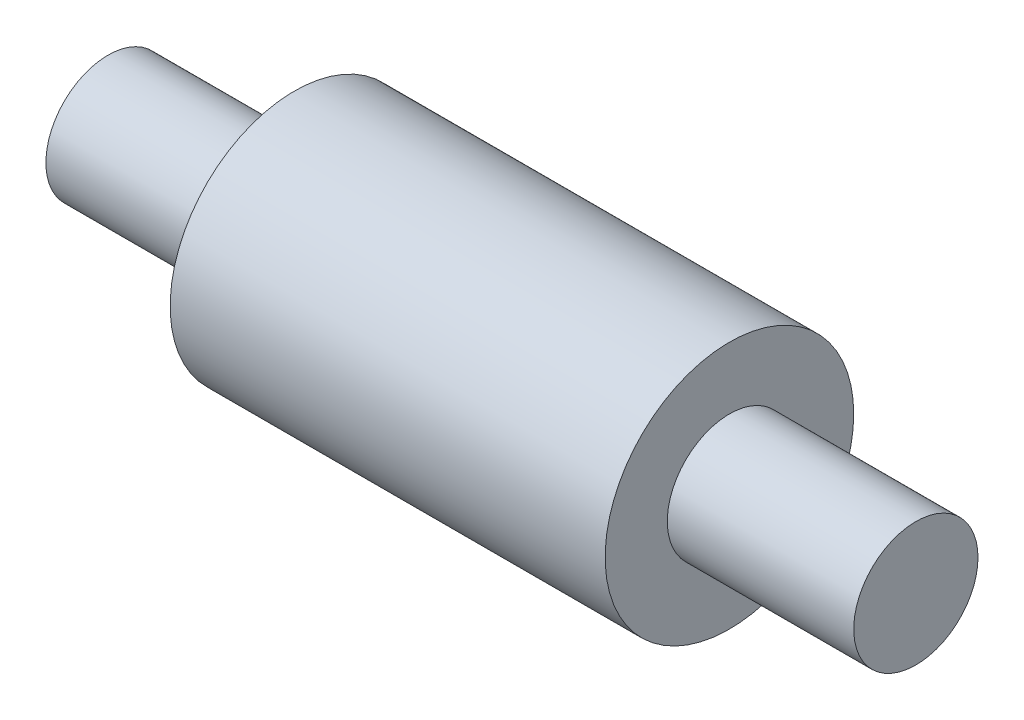
ISO-10303-21;
HEADER;
FILE_DESCRIPTION(('STEP AP214'),'2;1');
FILE_NAME('part.step','',(''),(''),'','','');
FILE_SCHEMA(('AUTOMOTIVE_DESIGN { 1 0 10303 214 1 1 1 1 }'));
ENDSEC;
DATA;
#1=APPLICATION_CONTEXT('core data for automotive mechanical design processes');
#2=APPLICATION_PROTOCOL_DEFINITION('international standard','automotive_design',2000,#1);
#3=PRODUCT_CONTEXT('',#1,'mechanical');
#4=PRODUCT('Part','Part','',(#3));
#5=PRODUCT_RELATED_PRODUCT_CATEGORY('part','',(#4));
#6=PRODUCT_DEFINITION_FORMATION('','',#4);
#7=PRODUCT_DEFINITION_CONTEXT('part definition',#1,'design');
#8=PRODUCT_DEFINITION('design','',#6,#7);
#9=PRODUCT_DEFINITION_SHAPE('','',#8);
#10=(LENGTH_UNIT() NAMED_UNIT(*) SI_UNIT(.MILLI.,.METRE.));
#11=(NAMED_UNIT(*) PLANE_ANGLE_UNIT() SI_UNIT($,.RADIAN.));
#12=(NAMED_UNIT(*) SI_UNIT($,.STERADIAN.) SOLID_ANGLE_UNIT());
#13=UNCERTAINTY_MEASURE_WITH_UNIT(LENGTH_MEASURE(1.E-05),#10,'distance_accuracy_value','');
#14=(GEOMETRIC_REPRESENTATION_CONTEXT(3) GLOBAL_UNCERTAINTY_ASSIGNED_CONTEXT((#13)) GLOBAL_UNIT_ASSIGNED_CONTEXT((#10,
#11,#12)) REPRESENTATION_CONTEXT('',''));
#15=CARTESIAN_POINT('',(0.,0.,0.));
#16=DIRECTION('',(0.,0.,1.));
#17=DIRECTION('',(1.,0.,0.));
#18=AXIS2_PLACEMENT_3D('',#15,#16,#17);
#19=CARTESIAN_POINT('',(-56.0165730239612,0.,0.));
#20=DIRECTION('',(-1.,0.,0.));
#21=DIRECTION('',(0.,0.,1.));
#22=AXIS2_PLACEMENT_3D('',#19,#20,#21);
#23=PLANE('',#22);
#24=CARTESIAN_POINT('',(-56.0165730239612,0.,4.07350323813278E-13));
#25=DIRECTION('',(1.,0.,0.));
#26=DIRECTION('',(0.,0.,-1.));
#27=AXIS2_PLACEMENT_3D('',#24,#25,#26);
#28=CIRCLE('',#27,10.0000000000004);
#29=CARTESIAN_POINT('',(-56.0165730239613,0.,-9.99999999999999));
#30=VERTEX_POINT('',#29);
#31=EDGE_CURVE('E10',#30,#30,#28,.T.);
#32=ORIENTED_EDGE('',*,*,#31,.F.);
#33=EDGE_LOOP('',(#32));
#34=FACE_BOUND('',#33,.T.);
#35=ADVANCED_FACE('F31',(#34),#23,.T.);
#36=CARTESIAN_POINT('',(0.,0.,0.));
#37=DIRECTION('',(1.,0.,0.));
#38=DIRECTION('',(0.,0.,-1.));
#39=AXIS2_PLACEMENT_3D('',#36,#37,#38);
#40=CYLINDRICAL_SURFACE('',#39,10.0000000000003);
#41=ORIENTED_EDGE('',*,*,#31,.T.);
#42=EDGE_LOOP('',(#41));
#43=FACE_BOUND('',#42,.T.);
#44=CARTESIAN_POINT('',(-26.0165730239612,0.,1.89191499474435E-13));
#45=DIRECTION('',(1.,0.,0.));
#46=DIRECTION('',(0.,0.,-1.));
#47=AXIS2_PLACEMENT_3D('',#44,#45,#46);
#48=CIRCLE('',#47,10.0000000000002);
#49=CARTESIAN_POINT('',(-26.0165730239613,0.,-9.99999999999999));
#50=VERTEX_POINT('',#49);
#51=EDGE_CURVE('E37',#50,#50,#48,.T.);
#52=ORIENTED_EDGE('',*,*,#51,.F.);
#53=EDGE_LOOP('',(#52));
#54=FACE_BOUND('',#53,.T.);
#55=ADVANCED_FACE('F73',(#43,#54),#40,.T.);
#56=CARTESIAN_POINT('',(-26.0165730239613,0.,-20.));
#57=DIRECTION('',(-1.,0.,0.));
#58=DIRECTION('',(0.,0.,1.));
#59=AXIS2_PLACEMENT_3D('',#56,#57,#58);
#60=PLANE('',#59);
#61=ORIENTED_EDGE('',*,*,#51,.T.);
#62=EDGE_LOOP('',(#61));
#63=FACE_BOUND('',#62,.T.);
#64=CARTESIAN_POINT('',(-26.0165730239611,0.,1.89191499474434E-13));
#65=DIRECTION('',(1.,0.,0.));
#66=DIRECTION('',(0.,0.,-1.));
#67=AXIS2_PLACEMENT_3D('',#64,#65,#66);
#68=CIRCLE('',#67,20.0000000000002);
#69=CARTESIAN_POINT('',(-26.0165730239613,0.,-20.));
#70=VERTEX_POINT('',#69);
#71=EDGE_CURVE('E41',#70,#70,#68,.T.);
#72=ORIENTED_EDGE('',*,*,#71,.F.);
#73=EDGE_LOOP('',(#72));
#74=FACE_BOUND('',#73,.T.);
#75=ADVANCED_FACE('F78',(#63,#74),#60,.T.);
#76=CARTESIAN_POINT('',(0.,0.,0.));
#77=DIRECTION('',(1.,0.,0.));
#78=DIRECTION('',(0.,0.,-1.));
#79=AXIS2_PLACEMENT_3D('',#76,#77,#78);
#80=CYLINDRICAL_SURFACE('',#79,19.9999999999999);
#81=ORIENTED_EDGE('',*,*,#71,.T.);
#82=EDGE_LOOP('',(#81));
#83=FACE_BOUND('',#82,.T.);
#84=CARTESIAN_POINT('',(43.9834269760389,0.,-3.198457573162E-13));
#85=DIRECTION('',(1.,0.,0.));
#86=DIRECTION('',(0.,0.,-1.));
#87=AXIS2_PLACEMENT_3D('',#84,#85,#86);
#88=CIRCLE('',#87,19.9999999999997);
#89=CARTESIAN_POINT('',(43.9834269760387,0.,-20.));
#90=VERTEX_POINT('',#89);
#91=EDGE_CURVE('E45',#90,#90,#88,.T.);
#92=ORIENTED_EDGE('',*,*,#91,.F.);
#93=EDGE_LOOP('',(#92));
#94=FACE_BOUND('',#93,.T.);
#95=ADVANCED_FACE('F69',(#83,#94),#80,.T.);
#96=CARTESIAN_POINT('',(43.9834269760388,0.,-9.99999999999999));
#97=DIRECTION('',(1.,0.,0.));
#98=DIRECTION('',(0.,0.,-1.));
#99=AXIS2_PLACEMENT_3D('',#96,#97,#98);
#100=PLANE('',#99);
#101=ORIENTED_EDGE('',*,*,#91,.T.);
#102=EDGE_LOOP('',(#101));
#103=FACE_BOUND('',#102,.T.);
#104=CARTESIAN_POINT('',(43.9834269760388,0.,-3.198457573162E-13));
#105=DIRECTION('',(1.,0.,0.));
#106=DIRECTION('',(0.,0.,-1.));
#107=AXIS2_PLACEMENT_3D('',#104,#105,#106);
#108=CIRCLE('',#107,9.99999999999967);
#109=CARTESIAN_POINT('',(43.9834269760387,0.,-9.99999999999999));
#110=VERTEX_POINT('',#109);
#111=EDGE_CURVE('E50',#110,#110,#108,.T.);
#112=ORIENTED_EDGE('',*,*,#111,.F.);
#113=EDGE_LOOP('',(#112));
#114=FACE_BOUND('',#113,.T.);
#115=ADVANCED_FACE('F61',(#103,#114),#100,.T.);
#116=CARTESIAN_POINT('',(0.,0.,0.));
#117=DIRECTION('',(1.,0.,0.));
#118=DIRECTION('',(0.,0.,-1.));
#119=AXIS2_PLACEMENT_3D('',#116,#117,#118);
#120=CYLINDRICAL_SURFACE('',#119,9.99999999999956);
#121=ORIENTED_EDGE('',*,*,#111,.T.);
#122=EDGE_LOOP('',(#121));
#123=FACE_BOUND('',#122,.T.);
#124=CARTESIAN_POINT('',(73.9834269760388,0.,-5.38004581655043E-13));
#125=DIRECTION('',(1.,0.,0.));
#126=DIRECTION('',(0.,0.,-1.));
#127=AXIS2_PLACEMENT_3D('',#124,#125,#126);
#128=CIRCLE('',#127,9.99999999999945);
#129=CARTESIAN_POINT('',(73.9834269760387,0.,-9.99999999999999));
#130=VERTEX_POINT('',#129);
#131=EDGE_CURVE('E53',#130,#130,#128,.T.);
#132=ORIENTED_EDGE('',*,*,#131,.F.);
#133=EDGE_LOOP('',(#132));
#134=FACE_BOUND('',#133,.T.);
#135=ADVANCED_FACE('F59',(#123,#134),#120,.T.);
#136=CARTESIAN_POINT('',(73.9834269760387,0.,-9.99999999999999));
#137=DIRECTION('',(1.,0.,0.));
#138=DIRECTION('',(0.,0.,-1.));
#139=AXIS2_PLACEMENT_3D('',#136,#137,#138);
#140=PLANE('',#139);
#141=ORIENTED_EDGE('',*,*,#131,.T.);
#142=EDGE_LOOP('',(#141));
#143=FACE_BOUND('',#142,.T.);
#144=ADVANCED_FACE('F57',(#143),#140,.T.);
#145=CLOSED_SHELL('',(#35,#55,#75,#95,#115,#135,#144));
#146=MANIFOLD_SOLID_BREP('B2',#145);
#147=ADVANCED_BREP_SHAPE_REPRESENTATION('',(#18,#146),#14);
#148=SHAPE_DEFINITION_REPRESENTATION(#9,#147);
ENDSEC;
END-ISO-10303-21;
